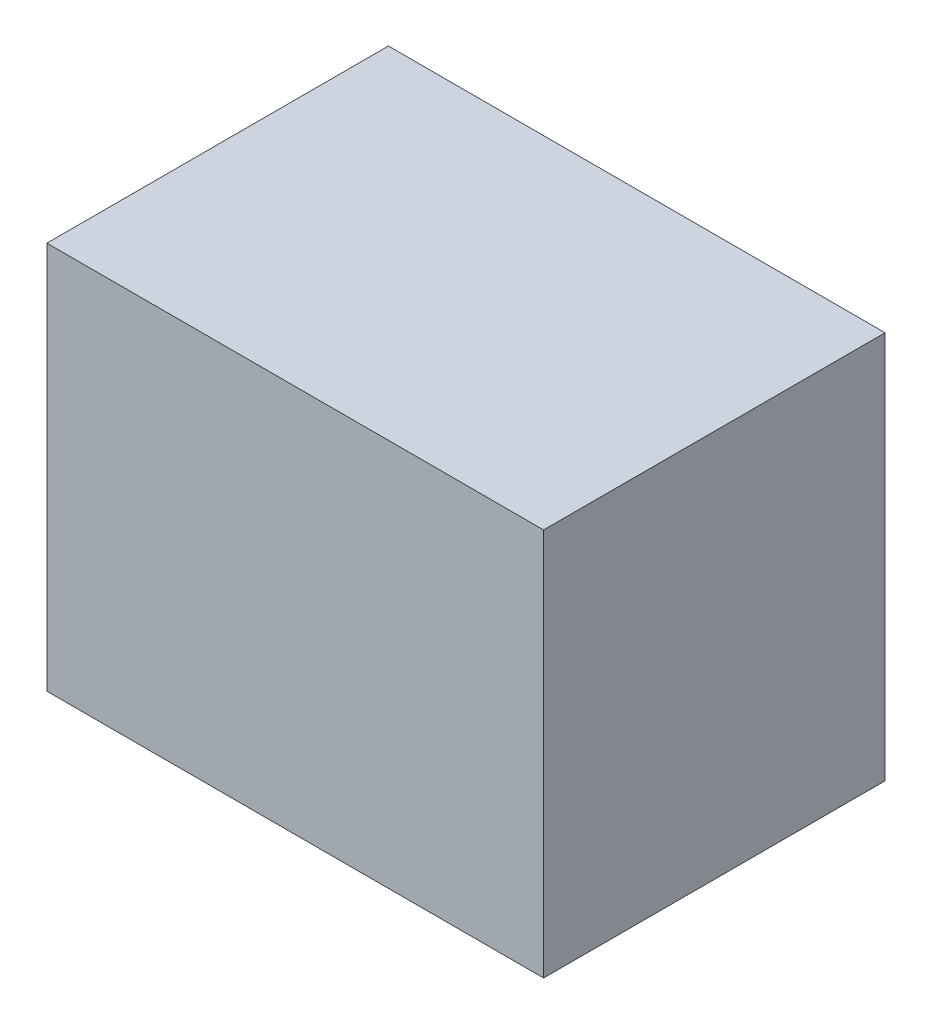
ISO-10303-21;
HEADER;
FILE_DESCRIPTION(('STEP AP214'),'2;1');
FILE_NAME('part.step','',(''),(''),'','','');
FILE_SCHEMA(('AUTOMOTIVE_DESIGN { 1 0 10303 214 1 1 1 1 }'));
ENDSEC;
DATA;
#1=APPLICATION_CONTEXT('core data for automotive mechanical design processes');
#2=APPLICATION_PROTOCOL_DEFINITION('international standard','automotive_design',2000,#1);
#3=PRODUCT_CONTEXT('',#1,'mechanical');
#4=PRODUCT('Part','Part','',(#3));
#5=PRODUCT_RELATED_PRODUCT_CATEGORY('part','',(#4));
#6=PRODUCT_DEFINITION_FORMATION('','',#4);
#7=PRODUCT_DEFINITION_CONTEXT('part definition',#1,'design');
#8=PRODUCT_DEFINITION('design','',#6,#7);
#9=PRODUCT_DEFINITION_SHAPE('','',#8);
#10=(LENGTH_UNIT() NAMED_UNIT(*) SI_UNIT(.MILLI.,.METRE.));
#11=(NAMED_UNIT(*) PLANE_ANGLE_UNIT() SI_UNIT($,.RADIAN.));
#12=(NAMED_UNIT(*) SI_UNIT($,.STERADIAN.) SOLID_ANGLE_UNIT());
#13=UNCERTAINTY_MEASURE_WITH_UNIT(LENGTH_MEASURE(1.E-05),#10,'distance_accuracy_value','');
#14=(GEOMETRIC_REPRESENTATION_CONTEXT(3) GLOBAL_UNCERTAINTY_ASSIGNED_CONTEXT((#13)) GLOBAL_UNIT_ASSIGNED_CONTEXT((#10,
#11,#12)) REPRESENTATION_CONTEXT('',''));
#15=CARTESIAN_POINT('',(0.,0.,0.));
#16=DIRECTION('',(0.,0.,1.));
#17=DIRECTION('',(1.,0.,0.));
#18=AXIS2_PLACEMENT_3D('',#15,#16,#17);
#19=CARTESIAN_POINT('',(0.,198.4375,0.));
#20=DIRECTION('',(1.,0.,0.));
#21=DIRECTION('',(0.,0.,-1.));
#22=AXIS2_PLACEMENT_3D('',#19,#20,#21);
#23=PLANE('',#22);
#24=DIRECTION('',(0.,0.,1.));
#25=VECTOR('',#24,1.);
#26=CARTESIAN_POINT('',(0.,0.,0.));
#27=LINE('',#26,#25);
#28=CARTESIAN_POINT('',(0.,0.,-174.625));
#29=VERTEX_POINT('',#28);
#30=CARTESIAN_POINT('',(0.,0.,0.));
#31=VERTEX_POINT('',#30);
#32=EDGE_CURVE('E98',#29,#31,#27,.T.);
#33=ORIENTED_EDGE('',*,*,#32,.T.);
#34=DIRECTION('',(0.,-1.,0.));
#35=VECTOR('',#34,1.);
#36=CARTESIAN_POINT('',(0.,198.4375,0.));
#37=LINE('',#36,#35);
#38=CARTESIAN_POINT('',(0.,198.4375,0.));
#39=VERTEX_POINT('',#38);
#40=EDGE_CURVE('E11',#39,#31,#37,.T.);
#41=ORIENTED_EDGE('',*,*,#40,.F.);
#42=DIRECTION('',(0.,0.,1.));
#43=VECTOR('',#42,1.);
#44=CARTESIAN_POINT('',(0.,198.4375,0.));
#45=LINE('',#44,#43);
#46=CARTESIAN_POINT('',(0.,198.4375,-174.625));
#47=VERTEX_POINT('',#46);
#48=EDGE_CURVE('E86',#47,#39,#45,.T.);
#49=ORIENTED_EDGE('',*,*,#48,.F.);
#50=DIRECTION('',(0.,-1.,0.));
#51=VECTOR('',#50,1.);
#52=CARTESIAN_POINT('',(0.,198.4375,-174.625));
#53=LINE('',#52,#51);
#54=EDGE_CURVE('E94',#47,#29,#53,.T.);
#55=ORIENTED_EDGE('',*,*,#54,.T.);
#56=EDGE_LOOP('',(#33,#41,#49,#55));
#57=FACE_BOUND('',#56,.T.);
#58=ADVANCED_FACE('F35',(#57),#23,.F.);
#59=CARTESIAN_POINT('',(0.,198.4375,0.));
#60=DIRECTION('',(0.,0.,-1.));
#61=DIRECTION('',(-1.,0.,0.));
#62=AXIS2_PLACEMENT_3D('',#59,#60,#61);
#63=PLANE('',#62);
#64=DIRECTION('',(1.,0.,0.));
#65=VECTOR('',#64,1.);
#66=CARTESIAN_POINT('',(0.,0.,0.));
#67=LINE('',#66,#65);
#68=CARTESIAN_POINT('',(254.,0.,0.));
#69=VERTEX_POINT('',#68);
#70=EDGE_CURVE('E90',#31,#69,#67,.T.);
#71=ORIENTED_EDGE('',*,*,#70,.T.);
#72=DIRECTION('',(0.,-1.,0.));
#73=VECTOR('',#72,1.);
#74=CARTESIAN_POINT('',(254.,198.4375,0.));
#75=LINE('',#74,#73);
#76=CARTESIAN_POINT('',(254.,198.4375,0.));
#77=VERTEX_POINT('',#76);
#78=EDGE_CURVE('E43',#77,#69,#75,.T.);
#79=ORIENTED_EDGE('',*,*,#78,.F.);
#80=DIRECTION('',(1.,0.,0.));
#81=VECTOR('',#80,1.);
#82=CARTESIAN_POINT('',(0.,198.4375,0.));
#83=LINE('',#82,#81);
#84=EDGE_CURVE('E81',#39,#77,#83,.T.);
#85=ORIENTED_EDGE('',*,*,#84,.F.);
#86=ORIENTED_EDGE('',*,*,#40,.T.);
#87=EDGE_LOOP('',(#71,#79,#85,#86));
#88=FACE_BOUND('',#87,.T.);
#89=ADVANCED_FACE('F89',(#88),#63,.F.);
#90=CARTESIAN_POINT('',(254.,198.4375,0.));
#91=DIRECTION('',(-1.,0.,0.));
#92=DIRECTION('',(0.,0.,1.));
#93=AXIS2_PLACEMENT_3D('',#90,#91,#92);
#94=PLANE('',#93);
#95=DIRECTION('',(0.,0.,-1.));
#96=VECTOR('',#95,1.);
#97=CARTESIAN_POINT('',(254.,0.,0.));
#98=LINE('',#97,#96);
#99=CARTESIAN_POINT('',(254.,0.,-174.625));
#100=VERTEX_POINT('',#99);
#101=EDGE_CURVE('E68',#69,#100,#98,.T.);
#102=ORIENTED_EDGE('',*,*,#101,.T.);
#103=DIRECTION('',(0.,-1.,0.));
#104=VECTOR('',#103,1.);
#105=CARTESIAN_POINT('',(254.,198.4375,-174.625));
#106=LINE('',#105,#104);
#107=CARTESIAN_POINT('',(254.,198.4375,-174.625));
#108=VERTEX_POINT('',#107);
#109=EDGE_CURVE('E91',#108,#100,#106,.T.);
#110=ORIENTED_EDGE('',*,*,#109,.F.);
#111=DIRECTION('',(0.,0.,-1.));
#112=VECTOR('',#111,1.);
#113=CARTESIAN_POINT('',(254.,198.4375,0.));
#114=LINE('',#113,#112);
#115=EDGE_CURVE('E84',#77,#108,#114,.T.);
#116=ORIENTED_EDGE('',*,*,#115,.F.);
#117=ORIENTED_EDGE('',*,*,#78,.T.);
#118=EDGE_LOOP('',(#102,#110,#116,#117));
#119=FACE_BOUND('',#118,.T.);
#120=ADVANCED_FACE('F92',(#119),#94,.F.);
#121=CARTESIAN_POINT('',(0.,198.4375,-174.625));
#122=DIRECTION('',(0.,0.,1.));
#123=DIRECTION('',(1.,0.,0.));
#124=AXIS2_PLACEMENT_3D('',#121,#122,#123);
#125=PLANE('',#124);
#126=DIRECTION('',(-1.,0.,0.));
#127=VECTOR('',#126,1.);
#128=CARTESIAN_POINT('',(0.,0.,-174.625));
#129=LINE('',#128,#127);
#130=EDGE_CURVE('E74',#100,#29,#129,.T.);
#131=ORIENTED_EDGE('',*,*,#130,.T.);
#132=ORIENTED_EDGE('',*,*,#54,.F.);
#133=DIRECTION('',(-1.,0.,0.));
#134=VECTOR('',#133,1.);
#135=CARTESIAN_POINT('',(0.,198.4375,-174.625));
#136=LINE('',#135,#134);
#137=EDGE_CURVE('E51',#108,#47,#136,.T.);
#138=ORIENTED_EDGE('',*,*,#137,.F.);
#139=ORIENTED_EDGE('',*,*,#109,.T.);
#140=EDGE_LOOP('',(#131,#132,#138,#139));
#141=FACE_BOUND('',#140,.T.);
#142=ADVANCED_FACE('F105',(#141),#125,.F.);
#143=CARTESIAN_POINT('',(0.,198.4375,0.));
#144=DIRECTION('',(0.,-1.,0.));
#145=DIRECTION('',(0.,0.,-1.));
#146=AXIS2_PLACEMENT_3D('',#143,#144,#145);
#147=PLANE('',#146);
#148=ORIENTED_EDGE('',*,*,#48,.T.);
#149=ORIENTED_EDGE('',*,*,#84,.T.);
#150=ORIENTED_EDGE('',*,*,#115,.T.);
#151=ORIENTED_EDGE('',*,*,#137,.T.);
#152=EDGE_LOOP('',(#148,#149,#150,#151));
#153=FACE_BOUND('',#152,.T.);
#154=ADVANCED_FACE('F82',(#153),#147,.F.);
#155=CARTESIAN_POINT('',(0.,0.,0.));
#156=DIRECTION('',(0.,-1.,0.));
#157=DIRECTION('',(0.,0.,-1.));
#158=AXIS2_PLACEMENT_3D('',#155,#156,#157);
#159=PLANE('',#158);
#160=ORIENTED_EDGE('',*,*,#32,.F.);
#161=ORIENTED_EDGE('',*,*,#130,.F.);
#162=ORIENTED_EDGE('',*,*,#101,.F.);
#163=ORIENTED_EDGE('',*,*,#70,.F.);
#164=EDGE_LOOP('',(#160,#161,#162,#163));
#165=FACE_BOUND('',#164,.T.);
#166=ADVANCED_FACE('F108',(#165),#159,.T.);
#167=CLOSED_SHELL('',(#58,#89,#120,#142,#154,#166));
#168=MANIFOLD_SOLID_BREP('B2',#167);
#169=ADVANCED_BREP_SHAPE_REPRESENTATION('',(#18,#168),#14);
#170=SHAPE_DEFINITION_REPRESENTATION(#9,#169);
ENDSEC;
END-ISO-10303-21;
